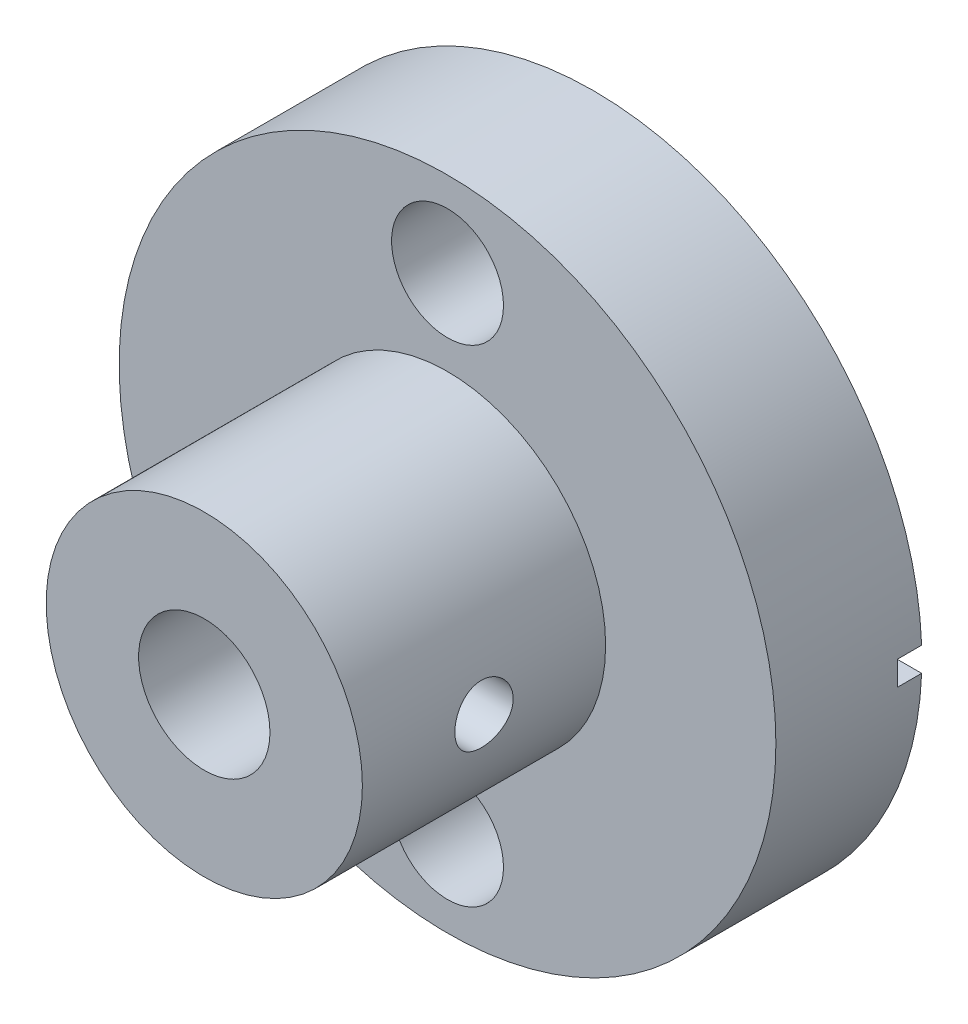
ISO-10303-21;
HEADER;
FILE_DESCRIPTION(('STEP AP214'),'2;1');
FILE_NAME('part.step','',(''),(''),'','','');
FILE_SCHEMA(('AUTOMOTIVE_DESIGN { 1 0 10303 214 1 1 1 1 }'));
ENDSEC;
DATA;
#1=APPLICATION_CONTEXT('core data for automotive mechanical design processes');
#2=APPLICATION_PROTOCOL_DEFINITION('international standard','automotive_design',2000,#1);
#3=PRODUCT_CONTEXT('',#1,'mechanical');
#4=PRODUCT('Part','Part','',(#3));
#5=PRODUCT_RELATED_PRODUCT_CATEGORY('part','',(#4));
#6=PRODUCT_DEFINITION_FORMATION('','',#4);
#7=PRODUCT_DEFINITION_CONTEXT('part definition',#1,'design');
#8=PRODUCT_DEFINITION('design','',#6,#7);
#9=PRODUCT_DEFINITION_SHAPE('','',#8);
#10=(LENGTH_UNIT() NAMED_UNIT(*) SI_UNIT(.MILLI.,.METRE.));
#11=(NAMED_UNIT(*) PLANE_ANGLE_UNIT() SI_UNIT($,.RADIAN.));
#12=(NAMED_UNIT(*) SI_UNIT($,.STERADIAN.) SOLID_ANGLE_UNIT());
#13=UNCERTAINTY_MEASURE_WITH_UNIT(LENGTH_MEASURE(1.E-05),#10,'distance_accuracy_value','');
#14=(GEOMETRIC_REPRESENTATION_CONTEXT(3) GLOBAL_UNCERTAINTY_ASSIGNED_CONTEXT((#13)) GLOBAL_UNIT_ASSIGNED_CONTEXT((#10,
#11,#12)) REPRESENTATION_CONTEXT('',''));
#15=CARTESIAN_POINT('',(0.,0.,0.));
#16=DIRECTION('',(0.,0.,1.));
#17=DIRECTION('',(1.,0.,0.));
#18=AXIS2_PLACEMENT_3D('',#15,#16,#17);
#19=CARTESIAN_POINT('',(0.,0.,6.));
#20=DIRECTION('',(0.,0.,-1.));
#21=DIRECTION('',(-1.,0.,0.));
#22=AXIS2_PLACEMENT_3D('',#19,#20,#21);
#23=CYLINDRICAL_SURFACE('',#22,13.5);
#24=CARTESIAN_POINT('',(0.,0.,6.));
#25=DIRECTION('',(0.,0.,1.));
#26=DIRECTION('',(1.,0.,0.));
#27=AXIS2_PLACEMENT_3D('',#24,#25,#26);
#28=CIRCLE('',#27,13.5);
#29=CARTESIAN_POINT('',(13.5,0.,6.));
#30=VERTEX_POINT('',#29);
#31=EDGE_CURVE('E196',#30,#30,#28,.T.);
#32=ORIENTED_EDGE('',*,*,#31,.F.);
#33=EDGE_LOOP('',(#32));
#34=FACE_BOUND('',#33,.T.);
#35=DIRECTION('',(0.,0.,-1.));
#36=VECTOR('',#35,1.);
#37=CARTESIAN_POINT('',(-13.490737563232,0.5,6.));
#38=LINE('',#37,#36);
#39=CARTESIAN_POINT('',(-13.490737563232,0.5,1.));
#40=VERTEX_POINT('',#39);
#41=CARTESIAN_POINT('',(-13.490737563232,0.5,0.));
#42=VERTEX_POINT('',#41);
#43=EDGE_CURVE('E127',#40,#42,#38,.T.);
#44=ORIENTED_EDGE('',*,*,#43,.F.);
#45=CARTESIAN_POINT('',(0.,0.,1.));
#46=DIRECTION('',(0.,0.,-1.));
#47=DIRECTION('',(-1.,0.,0.));
#48=AXIS2_PLACEMENT_3D('',#45,#46,#47);
#49=CIRCLE('',#48,13.5);
#50=CARTESIAN_POINT('',(-13.490737563232,-0.5,1.));
#51=VERTEX_POINT('',#50);
#52=EDGE_CURVE('E11',#51,#40,#49,.T.);
#53=ORIENTED_EDGE('',*,*,#52,.F.);
#54=DIRECTION('',(0.,0.,-1.));
#55=VECTOR('',#54,1.);
#56=CARTESIAN_POINT('',(-13.490737563232,-0.5,6.));
#57=LINE('',#56,#55);
#58=CARTESIAN_POINT('',(-13.490737563232,-0.5,0.));
#59=VERTEX_POINT('',#58);
#60=EDGE_CURVE('E104',#59,#51,#57,.F.);
#61=ORIENTED_EDGE('',*,*,#60,.F.);
#62=CARTESIAN_POINT('',(0.,0.,0.));
#63=DIRECTION('',(0.,0.,1.));
#64=DIRECTION('',(1.,0.,0.));
#65=AXIS2_PLACEMENT_3D('',#62,#63,#64);
#66=CIRCLE('',#65,13.5);
#67=CARTESIAN_POINT('',(13.490737563232,-0.5,0.));
#68=VERTEX_POINT('',#67);
#69=EDGE_CURVE('E201',#59,#68,#66,.T.);
#70=ORIENTED_EDGE('',*,*,#69,.T.);
#71=DIRECTION('',(0.,0.,-1.));
#72=VECTOR('',#71,1.);
#73=CARTESIAN_POINT('',(13.490737563232,-0.5,6.));
#74=LINE('',#73,#72);
#75=CARTESIAN_POINT('',(13.490737563232,-0.5,1.));
#76=VERTEX_POINT('',#75);
#77=EDGE_CURVE('E147',#68,#76,#74,.F.);
#78=ORIENTED_EDGE('',*,*,#77,.T.);
#79=CARTESIAN_POINT('',(0.,0.,1.));
#80=DIRECTION('',(0.,0.,-1.));
#81=DIRECTION('',(-1.,0.,0.));
#82=AXIS2_PLACEMENT_3D('',#79,#80,#81);
#83=CIRCLE('',#82,13.5);
#84=CARTESIAN_POINT('',(13.490737563232,0.5,1.));
#85=VERTEX_POINT('',#84);
#86=EDGE_CURVE('E195',#85,#76,#83,.T.);
#87=ORIENTED_EDGE('',*,*,#86,.F.);
#88=DIRECTION('',(0.,0.,-1.));
#89=VECTOR('',#88,1.);
#90=CARTESIAN_POINT('',(13.490737563232,0.5,6.));
#91=LINE('',#90,#89);
#92=CARTESIAN_POINT('',(13.490737563232,0.5,0.));
#93=VERTEX_POINT('',#92);
#94=EDGE_CURVE('E143',#85,#93,#91,.T.);
#95=ORIENTED_EDGE('',*,*,#94,.T.);
#96=EDGE_CURVE('E186',#93,#42,#66,.T.);
#97=ORIENTED_EDGE('',*,*,#96,.T.);
#98=EDGE_LOOP('',(#44,#53,#61,#70,#78,#87,#95,#97));
#99=FACE_BOUND('',#98,.T.);
#100=ADVANCED_FACE('F34',(#34,#99),#23,.T.);
#101=CARTESIAN_POINT('',(0.,0.,0.));
#102=DIRECTION('',(0.,0.,1.));
#103=DIRECTION('',(1.,0.,0.));
#104=AXIS2_PLACEMENT_3D('',#101,#102,#103);
#105=PLANE('',#104);
#106=CARTESIAN_POINT('',(0.,0.,0.));
#107=DIRECTION('',(0.,0.,1.));
#108=DIRECTION('',(1.,0.,0.));
#109=AXIS2_PLACEMENT_3D('',#106,#107,#108);
#110=CIRCLE('',#109,2.7);
#111=CARTESIAN_POINT('',(2.7,0.,0.));
#112=VERTEX_POINT('',#111);
#113=EDGE_CURVE('E250',#112,#112,#110,.F.);
#114=ORIENTED_EDGE('',*,*,#113,.F.);
#115=EDGE_LOOP('',(#114));
#116=FACE_BOUND('',#115,.T.);
#117=CARTESIAN_POINT('',(0.,10.,0.));
#118=DIRECTION('',(0.,0.,1.));
#119=DIRECTION('',(1.,0.,0.));
#120=AXIS2_PLACEMENT_3D('',#117,#118,#119);
#121=CIRCLE('',#120,2.3);
#122=CARTESIAN_POINT('',(2.3,10.,0.));
#123=VERTEX_POINT('',#122);
#124=EDGE_CURVE('E157',#123,#123,#121,.T.);
#125=ORIENTED_EDGE('',*,*,#124,.T.);
#126=EDGE_LOOP('',(#125));
#127=FACE_BOUND('',#126,.T.);
#128=CARTESIAN_POINT('',(0.,-10.,0.));
#129=DIRECTION('',(0.,0.,1.));
#130=DIRECTION('',(1.,0.,0.));
#131=AXIS2_PLACEMENT_3D('',#128,#129,#130);
#132=CIRCLE('',#131,2.3);
#133=CARTESIAN_POINT('',(2.3,-10.,0.));
#134=VERTEX_POINT('',#133);
#135=EDGE_CURVE('E153',#134,#134,#132,.F.);
#136=ORIENTED_EDGE('',*,*,#135,.F.);
#137=EDGE_LOOP('',(#136));
#138=FACE_BOUND('',#137,.T.);
#139=DIRECTION('',(-1.,0.,0.));
#140=VECTOR('',#139,1.);
#141=CARTESIAN_POINT('',(-18.5,0.5,0.));
#142=LINE('',#141,#140);
#143=CARTESIAN_POINT('',(-8.5,0.5,0.));
#144=VERTEX_POINT('',#143);
#145=EDGE_CURVE('E118',#144,#42,#142,.T.);
#146=ORIENTED_EDGE('',*,*,#145,.T.);
#147=ORIENTED_EDGE('',*,*,#96,.F.);
#148=DIRECTION('',(1.,0.,0.));
#149=VECTOR('',#148,1.);
#150=CARTESIAN_POINT('',(18.5,0.5,0.));
#151=LINE('',#150,#149);
#152=CARTESIAN_POINT('',(8.5,0.5,0.));
#153=VERTEX_POINT('',#152);
#154=EDGE_CURVE('E133',#153,#93,#151,.T.);
#155=ORIENTED_EDGE('',*,*,#154,.F.);
#156=DIRECTION('',(0.,1.,0.));
#157=VECTOR('',#156,1.);
#158=CARTESIAN_POINT('',(8.5,0.5,0.));
#159=LINE('',#158,#157);
#160=CARTESIAN_POINT('',(8.5,-0.5,0.));
#161=VERTEX_POINT('',#160);
#162=EDGE_CURVE('E56',#161,#153,#159,.T.);
#163=ORIENTED_EDGE('',*,*,#162,.F.);
#164=DIRECTION('',(1.,0.,0.));
#165=VECTOR('',#164,1.);
#166=CARTESIAN_POINT('',(0.,-0.5,0.));
#167=LINE('',#166,#165);
#168=EDGE_CURVE('E192',#161,#68,#167,.T.);
#169=ORIENTED_EDGE('',*,*,#168,.T.);
#170=ORIENTED_EDGE('',*,*,#69,.F.);
#171=DIRECTION('',(-1.,0.,0.));
#172=VECTOR('',#171,1.);
#173=CARTESIAN_POINT('',(0.,-0.5,0.));
#174=LINE('',#173,#172);
#175=CARTESIAN_POINT('',(-8.5,-0.5,0.));
#176=VERTEX_POINT('',#175);
#177=EDGE_CURVE('E41',#176,#59,#174,.T.);
#178=ORIENTED_EDGE('',*,*,#177,.F.);
#179=DIRECTION('',(0.,1.,0.));
#180=VECTOR('',#179,1.);
#181=CARTESIAN_POINT('',(-8.5,0.5,0.));
#182=LINE('',#181,#180);
#183=EDGE_CURVE('E48',#176,#144,#182,.T.);
#184=ORIENTED_EDGE('',*,*,#183,.T.);
#185=EDGE_LOOP('',(#146,#147,#155,#163,#169,#170,#178,#184));
#186=FACE_BOUND('',#185,.T.);
#187=ADVANCED_FACE('F203',(#116,#127,#138,#186),#105,.F.);
#188=CARTESIAN_POINT('',(25.,0.,11.));
#189=DIRECTION('',(-1.,0.,0.));
#190=DIRECTION('',(0.,0.,1.));
#191=AXIS2_PLACEMENT_3D('',#188,#189,#190);
#192=CYLINDRICAL_SURFACE('',#191,1.2);
#193=CARTESIAN_POINT('',(6.5,0.,12.2));
#194=CARTESIAN_POINT('',(6.49999879727572,-0.0667962993626081,12.1999974278829));
#195=CARTESIAN_POINT('',(6.49895972178335,-0.133626281673587,12.1944039721681));
#196=CARTESIAN_POINT('',(6.49491478174011,-0.265404300030401,12.172191600608));
#197=CARTESIAN_POINT('',(6.49190723570874,-0.330350677512255,12.1555632585209));
#198=CARTESIAN_POINT('',(6.48426191804226,-0.456436519782737,12.1118065638594));
#199=CARTESIAN_POINT('',(6.47962559903149,-0.517579319792999,12.0846875652248));
#200=CARTESIAN_POINT('',(6.46922952137734,-0.63444110969497,12.0207456276995));
#201=CARTESIAN_POINT('',(6.46346985907829,-0.690160564109868,11.9839235209079));
#202=CARTESIAN_POINT('',(6.45138834939994,-0.795247744205699,11.9011660344249));
#203=CARTESIAN_POINT('',(6.44506127279023,-0.844543292388614,11.8551397561373));
#204=CARTESIAN_POINT('',(6.43259702053078,-0.934759066401608,11.7554760006652));
#205=CARTESIAN_POINT('',(6.42645985829691,-0.975678701684754,11.7018379872634));
#206=CARTESIAN_POINT('',(6.41501951319584,-1.04827972317034,11.5879653111489));
#207=CARTESIAN_POINT('',(6.40972307507926,-1.07988798202191,11.5276832879546));
#208=CARTESIAN_POINT('',(6.40063738902812,-1.13250094978906,11.4025506689439));
#209=CARTESIAN_POINT('',(6.39684801526784,-1.15350654396689,11.3377004550609));
#210=CARTESIAN_POINT('',(6.39125806003697,-1.18408687284635,11.2060436035491));
#211=CARTESIAN_POINT('',(6.38943562620813,-1.19378730462821,11.1392671080334));
#212=CARTESIAN_POINT('',(6.38791998048299,-1.20187204389847,11.0050113933146));
#213=CARTESIAN_POINT('',(6.38822658354097,-1.20025733484479,10.9375322356926));
#214=CARTESIAN_POINT('',(6.39091446543458,-1.18585961873334,10.8046953870345));
#215=CARTESIAN_POINT('',(6.39326923845306,-1.17321929073711,10.7393216161376));
#216=CARTESIAN_POINT('',(6.39974652439446,-1.13735373323502,10.6116388619997));
#217=CARTESIAN_POINT('',(6.40386911035101,-1.11412806641468,10.5493300054981));
#218=CARTESIAN_POINT('',(6.41344535336497,-1.05761084900825,10.4291269281805));
#219=CARTESIAN_POINT('',(6.41890662438299,-1.0242614500129,10.3712605382117));
#220=CARTESIAN_POINT('',(6.43053982016241,-0.948484370023446,10.2618912881752));
#221=CARTESIAN_POINT('',(6.43671181488758,-0.906055794920213,10.2103890556326));
#222=CARTESIAN_POINT('',(6.44918666593044,-0.812554310960555,10.1143854911831));
#223=CARTESIAN_POINT('',(6.45549008145401,-0.761359307961523,10.0700030583735));
#224=CARTESIAN_POINT('',(6.46743086297198,-0.652187389345437,9.9904388129452));
#225=CARTESIAN_POINT('',(6.47306822266922,-0.594210409619175,9.95525708730987));
#226=CARTESIAN_POINT('',(6.48305257458405,-0.472998043002824,9.89507639819467));
#227=CARTESIAN_POINT('',(6.48739803241448,-0.409756516582691,9.87008953010376));
#228=CARTESIAN_POINT('',(6.49429705012122,-0.279875838888337,9.83112661435116));
#229=CARTESIAN_POINT('',(6.49685079444502,-0.213237038103507,9.8171494332818));
#230=CARTESIAN_POINT('',(6.49985338930874,-0.0794766430718829,9.80076752083491));
#231=CARTESIAN_POINT('',(6.50033187707818,-0.0123756497053712,9.79819983464421));
#232=CARTESIAN_POINT('',(6.49921181273706,0.121296981962713,9.8042730761626));
#233=CARTESIAN_POINT('',(6.49761335943468,0.187868645294989,9.8129134706596));
#234=CARTESIAN_POINT('',(6.49253745576473,0.318077984755796,9.84102211191283));
#235=CARTESIAN_POINT('',(6.48907427500552,0.381734009693139,9.86040816155233));
#236=CARTESIAN_POINT('',(6.4806556240529,0.504892375398316,9.9093690573418));
#237=CARTESIAN_POINT('',(6.47570005497306,0.564394440600633,9.93894457867032));
#238=CARTESIAN_POINT('',(6.4647724074758,0.678253095830679,10.0078073610227));
#239=CARTESIAN_POINT('',(6.45879008348503,0.732548265605505,10.0471945163265));
#240=CARTESIAN_POINT('',(6.44649953986676,0.833816870545852,10.1344270136108));
#241=CARTESIAN_POINT('',(6.44019129083715,0.880789643607566,10.1822731196305));
#242=CARTESIAN_POINT('',(6.42786191143313,0.966697085412809,10.2858021083737));
#243=CARTESIAN_POINT('',(6.42184551244879,1.00552070246097,10.3415777973493));
#244=CARTESIAN_POINT('',(6.41087523291019,1.07324774919417,10.4589549357169));
#245=CARTESIAN_POINT('',(6.40592131362856,1.10215154047974,10.5205561726499));
#246=CARTESIAN_POINT('',(6.39767379439307,1.14905975241548,10.6475497087302));
#247=CARTESIAN_POINT('',(6.39437235713613,1.16711570494917,10.7129224406376));
#248=CARTESIAN_POINT('',(6.38978543443045,1.19197513111159,10.8458401771607));
#249=CARTESIAN_POINT('',(6.38849972926177,1.19877983115992,10.9133849441999));
#250=CARTESIAN_POINT('',(6.3881007482456,1.20090353537778,11.0476175572827));
#251=CARTESIAN_POINT('',(6.38895435075601,1.19639765292492,11.1143025975303));
#252=CARTESIAN_POINT('',(6.39266448585662,1.17641079397786,11.2459474188607));
#253=CARTESIAN_POINT('',(6.39552100733921,1.16092987834811,11.310907209509));
#254=CARTESIAN_POINT('',(6.40290136886896,1.11950532017773,11.4371671962626));
#255=CARTESIAN_POINT('',(6.40742227523992,1.09358007946632,11.4984736122883));
#256=CARTESIAN_POINT('',(6.41762418955728,1.032021760182,11.6158947376739));
#257=CARTESIAN_POINT('',(6.42330527598439,0.996388024820644,11.6720090954421));
#258=CARTESIAN_POINT('',(6.43529057182139,0.915813071798076,11.7783315161889));
#259=CARTESIAN_POINT('',(6.44160263227606,0.870744203302652,11.8284419719686));
#260=CARTESIAN_POINT('',(6.45407937835197,0.772845002820405,11.9204475390134));
#261=CARTESIAN_POINT('',(6.46024402977463,0.720012889705214,11.9623407598269));
#262=CARTESIAN_POINT('',(6.47179409996219,0.607537484977904,12.0370617405115));
#263=CARTESIAN_POINT('',(6.47717228318667,0.547839004017674,12.0698075747291));
#264=CARTESIAN_POINT('',(6.48647285935735,0.42370854944922,12.124752828699));
#265=CARTESIAN_POINT('',(6.49039663100581,0.3592811283988,12.1469622420194));
#266=CARTESIAN_POINT('',(6.49553807584249,0.245545866371185,12.1756491928211));
#267=CARTESIAN_POINT('',(6.49720192234607,0.196906528350574,12.1847652844566));
#268=CARTESIAN_POINT('',(6.49943331626516,0.0988509306569767,12.1969415668264));
#269=CARTESIAN_POINT('',(6.50000089011371,0.0494346897454305,12.2000019035757));
#270=CARTESIAN_POINT('',(6.5,0.,12.2));
#271=B_SPLINE_CURVE_WITH_KNOTS('',3,(#193,#194,#195,#196,#197,#198,#199,#200,#201,#202,#203,
#204,#205,#206,#207,#208,#209,#210,#211,#212,#213,#214,#215,#216,#217,#218,#219,#220,#221,#222,
#223,#224,#225,#226,#227,#228,#229,#230,#231,#232,#233,#234,#235,#236,#237,#238,#239,#240,#241,
#242,#243,#244,#245,#246,#247,#248,#249,#250,#251,#252,#253,#254,#255,#256,#257,#258,#259,#260,
#261,#262,#263,#264,#265,#266,#267,#268,#269,#270),.UNSPECIFIED.,.T.,.F.,(4,2,2,2,2,2,2,2,2,2,2,
2,2,2,2,2,2,2,2,2,2,2,2,2,2,2,2,2,2,2,2,2,2,2,2,2,2,2,4),(0.,0.200208125257265,
0.400587493204053,0.600788604213543,0.800972552376601,1.00324088953467,1.20552348279051,
1.40935476877731,1.61316903319364,1.81469487992138,2.01620321120369,2.21514193787252,
2.41408888408644,2.61419475105378,2.81432033334393,3.01750151628566,3.2206846200298,
3.42410808829514,3.6275106121083,3.8279985269071,4.02847690406412,4.22744250539259,
4.42642129319003,4.62751523490318,4.8286273493452,5.03232388047527,5.23601298560803,
5.43872666786995,5.64141825228765,5.84099112816951,6.04056289728494,6.23978456857919,
6.43901972074741,6.64114822168659,6.84332316977221,7.04725467103852,7.25099235904022,
7.39916621446434,7.54733649711547),.UNSPECIFIED.);
#272=CARTESIAN_POINT('',(6.5,0.,12.2));
#273=VERTEX_POINT('',#272);
#274=EDGE_CURVE('E246',#273,#273,#271,.T.);
#275=ORIENTED_EDGE('',*,*,#274,.T.);
#276=EDGE_LOOP('',(#275));
#277=FACE_BOUND('',#276,.T.);
#278=CARTESIAN_POINT('',(2.7,0.,12.2));
#279=CARTESIAN_POINT('',(2.69999413362057,0.0639065591023064,12.1999923831793));
#280=CARTESIAN_POINT('',(2.69770564197874,0.127893036523807,12.1948654918272));
#281=CARTESIAN_POINT('',(2.68877100210596,0.25403557600969,12.1745501771965));
#282=CARTESIAN_POINT('',(2.68211438349655,0.316186864128076,12.1593375776189));
#283=CARTESIAN_POINT('',(2.66515409854901,0.436621100359764,12.1195393890298));
#284=CARTESIAN_POINT('',(2.65486345340692,0.494916988807218,12.0949872409192));
#285=CARTESIAN_POINT('',(2.63161770990452,0.606498876298807,12.0373549198206));
#286=CARTESIAN_POINT('',(2.61866321902908,0.659786013548984,12.0042766907538));
#287=CARTESIAN_POINT('',(2.59055992340384,0.762887990999931,11.9285990703182));
#288=CARTESIAN_POINT('',(2.57533308413914,0.81238898179779,11.8856014072593));
#289=CARTESIAN_POINT('',(2.54471118380751,0.903753990005821,11.7921510489153));
#290=CARTESIAN_POINT('',(2.52931602821855,0.945613455081426,11.7416939419488));
#291=CARTESIAN_POINT('',(2.49909628261832,1.02290764342971,11.6312367647985));
#292=CARTESIAN_POINT('',(2.48435595827186,1.05783186961991,11.5708539108751));
#293=CARTESIAN_POINT('',(2.45837526696494,1.11688834822608,11.4443268523912));
#294=CARTESIAN_POINT('',(2.44713285796118,1.14102690079927,11.3781860382369));
#295=CARTESIAN_POINT('',(2.43027734905002,1.17648691470213,11.2456277716151));
#296=CARTESIAN_POINT('',(2.42439919523154,1.18841590189109,11.1794079593235));
#297=CARTESIAN_POINT('',(2.41818878362474,1.20100696979013,11.0456661379365));
#298=CARTESIAN_POINT('',(2.4178528219447,1.20167657524167,10.9781450287237));
#299=CARTESIAN_POINT('',(2.42254366026567,1.19218298581507,10.8501827308142));
#300=CARTESIAN_POINT('',(2.4270931542614,1.18298402341183,10.7896487784958));
#301=CARTESIAN_POINT('',(2.44022617227002,1.15564860756994,10.6710948650284));
#302=CARTESIAN_POINT('',(2.44881060282323,1.13751014562483,10.6130754720334));
#303=CARTESIAN_POINT('',(2.46924514284841,1.09245124275327,10.4996398233602));
#304=CARTESIAN_POINT('',(2.48116423077023,1.06534281441842,10.4443112329153));
#305=CARTESIAN_POINT('',(2.50691446994658,1.00324870493604,10.3387544513155));
#306=CARTESIAN_POINT('',(2.52074642529426,0.968259707202767,10.2885284205557));
#307=CARTESIAN_POINT('',(2.55039983349783,0.887404851023686,10.1894518391137));
#308=CARTESIAN_POINT('',(2.56628383219961,0.840811456550148,10.1412119129495));
#309=CARTESIAN_POINT('',(2.59712939767392,0.740062927274395,10.0530095338656));
#310=CARTESIAN_POINT('',(2.61209068461612,0.68590551463452,10.0130495834241));
#311=CARTESIAN_POINT('',(2.63995469383987,0.569491655107122,9.94147206336678));
#312=CARTESIAN_POINT('',(2.6527835515846,0.507043222559378,9.91013579408398));
#313=CARTESIAN_POINT('',(2.67435348404006,0.377044453719878,9.85863383005269));
#314=CARTESIAN_POINT('',(2.68309713525878,0.309497364424834,9.83846109306621));
#315=CARTESIAN_POINT('',(2.69500955063424,0.176292321296718,9.81121287038837));
#316=CARTESIAN_POINT('',(2.69852547661778,0.110832697825019,9.80331998164941));
#317=CARTESIAN_POINT('',(2.70072002319156,-0.020566223274589,9.7983781261587));
#318=CARTESIAN_POINT('',(2.69940028683998,-0.0865053503783305,9.80132547611901));
#319=CARTESIAN_POINT('',(2.69229177327389,-0.212944450043092,9.8174261436085));
#320=CARTESIAN_POINT('',(2.6867671065459,-0.273537850639587,9.8299765355117));
#321=CARTESIAN_POINT('',(2.67210325388452,-0.391675243775097,9.86405478746183));
#322=CARTESIAN_POINT('',(2.66296362867872,-0.449218864755503,9.88558373855752));
#323=CARTESIAN_POINT('',(2.64157426404399,-0.561662431159979,9.93769332944624));
#324=CARTESIAN_POINT('',(2.62923639136989,-0.616423892001831,9.96853540826862));
#325=CARTESIAN_POINT('',(2.60272873830794,-0.720191567250078,10.0381108556107));
#326=CARTESIAN_POINT('',(2.58855816108654,-0.769195260470478,10.0768476608872));
#327=CARTESIAN_POINT('',(2.5584767589195,-0.864220327521456,10.1647500678792));
#328=CARTESIAN_POINT('',(2.54251772459568,-0.909683032438224,10.2145045624883));
#329=CARTESIAN_POINT('',(2.51162480970985,-0.991801453598339,10.3211332041893));
#330=CARTESIAN_POINT('',(2.49669129392246,-1.02845404757698,10.3780098645164));
#331=CARTESIAN_POINT('',(2.46928674093927,-1.09264543882237,10.4990745846855));
#332=CARTESIAN_POINT('',(2.45688177642213,-1.11994996636762,10.5634029898212));
#333=CARTESIAN_POINT('',(2.4367650168031,-1.16307895210515,10.6964760891825));
#334=CARTESIAN_POINT('',(2.42904862954254,-1.1789146462074,10.7652163890263));
#335=CARTESIAN_POINT('',(2.41995032134622,-1.19747128693734,10.8988889457178));
#336=CARTESIAN_POINT('',(2.41808692940897,-1.20119006801553,10.9636501271561));
#337=CARTESIAN_POINT('',(2.41959773517966,-1.19814464927904,11.0928557618811));
#338=CARTESIAN_POINT('',(2.42297081605554,-1.19138268479251,11.157300279765));
#339=CARTESIAN_POINT('',(2.43410978875393,-1.16844135931616,11.2800151564985));
#340=CARTESIAN_POINT('',(2.44159919634577,-1.15285303217351,11.3384237119317));
#341=CARTESIAN_POINT('',(2.45987368091073,-1.11332516751525,11.4517891509191));
#342=CARTESIAN_POINT('',(2.4706597105559,-1.08938321564955,11.5067450311624));
#343=CARTESIAN_POINT('',(2.49516633461298,-1.03207265496533,11.6155025669727));
#344=CARTESIAN_POINT('',(2.50903068581858,-0.998198297609607,11.6690045975486));
#345=CARTESIAN_POINT('',(2.53778753442993,-0.922641583993335,11.7698748803223));
#346=CARTESIAN_POINT('',(2.55268045962436,-0.880955966494673,11.8172405565419));
#347=CARTESIAN_POINT('',(2.58337941872399,-0.78664877081698,11.9087734791821));
#348=CARTESIAN_POINT('',(2.59915136690634,-0.733389540278599,11.9522984992548));
#349=CARTESIAN_POINT('',(2.62855906078181,-0.619771086799431,12.0298610087285));
#350=CARTESIAN_POINT('',(2.64219382936338,-0.559408638242745,12.0638941639895));
#351=CARTESIAN_POINT('',(2.66567555365819,-0.433830067434941,12.1209347672237));
#352=CARTESIAN_POINT('',(2.67556359629795,-0.368676545242857,12.1440625356446));
#353=CARTESIAN_POINT('',(2.69059030099947,-0.234972811511182,12.178782185816));
#354=CARTESIAN_POINT('',(2.69574344748542,-0.166433639459938,12.1904092575191));
#355=CARTESIAN_POINT('',(2.69941490841779,-0.0650184194495728,12.1986821692355));
#356=CARTESIAN_POINT('',(2.70000298517181,-0.032519556731023,12.2000038759031));
#357=CARTESIAN_POINT('',(2.7,0.,12.2));
#358=B_SPLINE_CURVE_WITH_KNOTS('',3,(#278,#279,#280,#281,#282,#283,#284,#285,#286,#287,#288,
#289,#290,#291,#292,#293,#294,#295,#296,#297,#298,#299,#300,#301,#302,#303,#304,#305,#306,#307,
#308,#309,#310,#311,#312,#313,#314,#315,#316,#317,#318,#319,#320,#321,#322,#323,#324,#325,#326,
#327,#328,#329,#330,#331,#332,#333,#334,#335,#336,#337,#338,#339,#340,#341,#342,#343,#344,#345,
#346,#347,#348,#349,#350,#351,#352,#353,#354,#355,#356,#357),.UNSPECIFIED.,.T.,.F.,(4,2,2,2,2,2,
2,2,2,2,2,2,2,2,2,2,2,2,2,2,2,2,2,2,2,2,2,2,2,2,2,2,2,2,2,2,2,2,2,4),(0.,0.191618254692132,
0.383697503423909,0.57509537585916,0.766449648689667,0.96752346516017,1.16871668045946,
1.38152637924487,1.59421160802032,1.7957068529561,1.99706743153409,2.18040510018399,
2.36378397951647,2.55127911192394,2.73885330073873,2.94470008049905,3.15060898340504,
3.3626003754159,3.57445788501979,3.77149687786056,3.96846892713029,4.15399671722493,
4.33954705869644,4.53088617326196,4.72230876076459,4.92915910001196,5.13608263838593,
5.34786609388025,5.55944178537991,5.753084399156,5.94668571861527,6.12863978970841,
6.31064649247104,6.50431618226569,6.69806691096097,6.9087661101249,7.11956136104833,
7.32797307084532,7.53574508917101,7.63325214934906),.UNSPECIFIED.);
#359=CARTESIAN_POINT('',(2.7,0.,12.2));
#360=VERTEX_POINT('',#359);
#361=EDGE_CURVE('E158',#360,#360,#358,.T.);
#362=ORIENTED_EDGE('',*,*,#361,.T.);
#363=EDGE_LOOP('',(#362));
#364=FACE_BOUND('',#363,.T.);
#365=ADVANCED_FACE('F168',(#277,#364),#192,.F.);
#366=CARTESIAN_POINT('',(-6.5,0.,12.2));
#367=CARTESIAN_POINT('',(-6.49999879727572,0.0667962993626081,12.1999974278829));
#368=CARTESIAN_POINT('',(-6.49895972178335,0.133626281673587,12.1944039721681));
#369=CARTESIAN_POINT('',(-6.49491478174011,0.265404300030401,12.172191600608));
#370=CARTESIAN_POINT('',(-6.49190723570874,0.330350677512255,12.1555632585209));
#371=CARTESIAN_POINT('',(-6.48426191804226,0.456436519782737,12.1118065638594));
#372=CARTESIAN_POINT('',(-6.47962559903149,0.517579319792999,12.0846875652248));
#373=CARTESIAN_POINT('',(-6.46922952137734,0.63444110969497,12.0207456276995));
#374=CARTESIAN_POINT('',(-6.46346985907829,0.690160564109868,11.9839235209079));
#375=CARTESIAN_POINT('',(-6.45138834939994,0.795247744205699,11.9011660344249));
#376=CARTESIAN_POINT('',(-6.44506127279023,0.844543292388614,11.8551397561373));
#377=CARTESIAN_POINT('',(-6.43259702053078,0.934759066401608,11.7554760006652));
#378=CARTESIAN_POINT('',(-6.42645985829691,0.975678701684754,11.7018379872634));
#379=CARTESIAN_POINT('',(-6.41501951319584,1.04827972317034,11.5879653111489));
#380=CARTESIAN_POINT('',(-6.40972307507926,1.07988798202191,11.5276832879546));
#381=CARTESIAN_POINT('',(-6.40063738902812,1.13250094978906,11.4025506689439));
#382=CARTESIAN_POINT('',(-6.39684801526784,1.15350654396689,11.3377004550609));
#383=CARTESIAN_POINT('',(-6.39125806003697,1.18408687284635,11.2060436035491));
#384=CARTESIAN_POINT('',(-6.38943562620813,1.19378730462821,11.1392671080334));
#385=CARTESIAN_POINT('',(-6.38791998048299,1.20187204389847,11.0050113933146));
#386=CARTESIAN_POINT('',(-6.38822658354097,1.20025733484479,10.9375322356926));
#387=CARTESIAN_POINT('',(-6.39091446543458,1.18585961873334,10.8046953870345));
#388=CARTESIAN_POINT('',(-6.39326923845306,1.17321929073711,10.7393216161376));
#389=CARTESIAN_POINT('',(-6.39974652439446,1.13735373323502,10.6116388619997));
#390=CARTESIAN_POINT('',(-6.40386911035101,1.11412806641468,10.5493300054981));
#391=CARTESIAN_POINT('',(-6.41344535336497,1.05761084900825,10.4291269281805));
#392=CARTESIAN_POINT('',(-6.41890662438299,1.0242614500129,10.3712605382117));
#393=CARTESIAN_POINT('',(-6.43053982016241,0.948484370023446,10.2618912881752));
#394=CARTESIAN_POINT('',(-6.43671181488758,0.906055794920213,10.2103890556326));
#395=CARTESIAN_POINT('',(-6.44918666593044,0.812554310960555,10.1143854911831));
#396=CARTESIAN_POINT('',(-6.45549008145401,0.761359307961523,10.0700030583735));
#397=CARTESIAN_POINT('',(-6.46743086297198,0.652187389345437,9.9904388129452));
#398=CARTESIAN_POINT('',(-6.47306822266922,0.594210409619175,9.95525708730987));
#399=CARTESIAN_POINT('',(-6.48305257458405,0.472998043002824,9.89507639819467));
#400=CARTESIAN_POINT('',(-6.48739803241448,0.409756516582691,9.87008953010376));
#401=CARTESIAN_POINT('',(-6.49429705012122,0.279875838888337,9.83112661435116));
#402=CARTESIAN_POINT('',(-6.49685079444502,0.213237038103507,9.8171494332818));
#403=CARTESIAN_POINT('',(-6.49985338930874,0.0794766430718829,9.80076752083491));
#404=CARTESIAN_POINT('',(-6.50033187707818,0.0123756497053712,9.79819983464421));
#405=CARTESIAN_POINT('',(-6.49921181273706,-0.121296981962713,9.8042730761626));
#406=CARTESIAN_POINT('',(-6.49761335943468,-0.187868645294989,9.8129134706596));
#407=CARTESIAN_POINT('',(-6.49253745576473,-0.318077984755796,9.84102211191283));
#408=CARTESIAN_POINT('',(-6.48907427500552,-0.381734009693139,9.86040816155233));
#409=CARTESIAN_POINT('',(-6.4806556240529,-0.504892375398316,9.9093690573418));
#410=CARTESIAN_POINT('',(-6.47570005497306,-0.564394440600633,9.93894457867032));
#411=CARTESIAN_POINT('',(-6.4647724074758,-0.678253095830679,10.0078073610227));
#412=CARTESIAN_POINT('',(-6.45879008348503,-0.732548265605505,10.0471945163265));
#413=CARTESIAN_POINT('',(-6.44649953986676,-0.833816870545852,10.1344270136108));
#414=CARTESIAN_POINT('',(-6.44019129083715,-0.880789643607566,10.1822731196305));
#415=CARTESIAN_POINT('',(-6.42786191143313,-0.966697085412809,10.2858021083737));
#416=CARTESIAN_POINT('',(-6.42184551244879,-1.00552070246097,10.3415777973493));
#417=CARTESIAN_POINT('',(-6.41087523291019,-1.07324774919417,10.4589549357169));
#418=CARTESIAN_POINT('',(-6.40592131362856,-1.10215154047974,10.5205561726499));
#419=CARTESIAN_POINT('',(-6.39767379439307,-1.14905975241548,10.6475497087302));
#420=CARTESIAN_POINT('',(-6.39437235713613,-1.16711570494917,10.7129224406376));
#421=CARTESIAN_POINT('',(-6.38978543443045,-1.19197513111159,10.8458401771607));
#422=CARTESIAN_POINT('',(-6.38849972926177,-1.19877983115992,10.9133849441999));
#423=CARTESIAN_POINT('',(-6.3881007482456,-1.20090353537778,11.0476175572827));
#424=CARTESIAN_POINT('',(-6.38895435075601,-1.19639765292492,11.1143025975303));
#425=CARTESIAN_POINT('',(-6.39266448585662,-1.17641079397786,11.2459474188607));
#426=CARTESIAN_POINT('',(-6.39552100733921,-1.16092987834811,11.310907209509));
#427=CARTESIAN_POINT('',(-6.40290136886896,-1.11950532017773,11.4371671962626));
#428=CARTESIAN_POINT('',(-6.40742227523992,-1.09358007946632,11.4984736122883));
#429=CARTESIAN_POINT('',(-6.41762418955728,-1.032021760182,11.6158947376739));
#430=CARTESIAN_POINT('',(-6.42330527598439,-0.996388024820644,11.6720090954421));
#431=CARTESIAN_POINT('',(-6.43529057182139,-0.915813071798076,11.7783315161889));
#432=CARTESIAN_POINT('',(-6.44160263227606,-0.870744203302652,11.8284419719686));
#433=CARTESIAN_POINT('',(-6.45407937835197,-0.772845002820405,11.9204475390134));
#434=CARTESIAN_POINT('',(-6.46024402977463,-0.720012889705214,11.9623407598269));
#435=CARTESIAN_POINT('',(-6.47179409996219,-0.607537484977904,12.0370617405115));
#436=CARTESIAN_POINT('',(-6.47717228318667,-0.547839004017674,12.0698075747291));
#437=CARTESIAN_POINT('',(-6.48647285935735,-0.42370854944922,12.124752828699));
#438=CARTESIAN_POINT('',(-6.49039663100581,-0.3592811283988,12.1469622420194));
#439=CARTESIAN_POINT('',(-6.49553807584249,-0.245545866371185,12.1756491928211));
#440=CARTESIAN_POINT('',(-6.49720192234607,-0.196906528350574,12.1847652844566));
#441=CARTESIAN_POINT('',(-6.49943331626516,-0.0988509306569767,12.1969415668264));
#442=CARTESIAN_POINT('',(-6.50000089011371,-0.0494346897454305,12.2000019035757));
#443=CARTESIAN_POINT('',(-6.5,0.,12.2));
#444=B_SPLINE_CURVE_WITH_KNOTS('',3,(#366,#367,#368,#369,#370,#371,#372,#373,#374,#375,#376,
#377,#378,#379,#380,#381,#382,#383,#384,#385,#386,#387,#388,#389,#390,#391,#392,#393,#394,#395,
#396,#397,#398,#399,#400,#401,#402,#403,#404,#405,#406,#407,#408,#409,#410,#411,#412,#413,#414,
#415,#416,#417,#418,#419,#420,#421,#422,#423,#424,#425,#426,#427,#428,#429,#430,#431,#432,#433,
#434,#435,#436,#437,#438,#439,#440,#441,#442,#443),.UNSPECIFIED.,.T.,.F.,(4,2,2,2,2,2,2,2,2,2,2,
2,2,2,2,2,2,2,2,2,2,2,2,2,2,2,2,2,2,2,2,2,2,2,2,2,2,2,4),(0.,0.200208125257265,
0.400587493204053,0.600788604213543,0.800972552376601,1.00324088953467,1.20552348279051,
1.40935476877731,1.61316903319364,1.81469487992138,2.01620321120369,2.21514193787252,
2.41408888408644,2.61419475105378,2.81432033334393,3.01750151628566,3.2206846200298,
3.42410808829514,3.6275106121083,3.8279985269071,4.02847690406412,4.22744250539259,
4.42642129319003,4.62751523490318,4.8286273493452,5.03232388047527,5.23601298560803,
5.43872666786995,5.64141825228765,5.84099112816951,6.04056289728494,6.23978456857919,
6.43901972074741,6.64114822168659,6.84332316977221,7.04725467103852,7.25099235904022,
7.39916621446434,7.54733649711547),.UNSPECIFIED.);
#445=CARTESIAN_POINT('',(-6.5,0.,12.2));
#446=VERTEX_POINT('',#445);
#447=EDGE_CURVE('E212',#446,#446,#444,.T.);
#448=ORIENTED_EDGE('',*,*,#447,.T.);
#449=EDGE_LOOP('',(#448));
#450=FACE_BOUND('',#449,.T.);
#451=CARTESIAN_POINT('',(-2.7,0.,12.2));
#452=CARTESIAN_POINT('',(-2.69999413362057,-0.0639065591023064,12.1999923831793));
#453=CARTESIAN_POINT('',(-2.69770564197874,-0.127893036523807,12.1948654918272));
#454=CARTESIAN_POINT('',(-2.68877100210596,-0.25403557600969,12.1745501771965));
#455=CARTESIAN_POINT('',(-2.68211438349655,-0.316186864128076,12.1593375776189));
#456=CARTESIAN_POINT('',(-2.66515409854901,-0.436621100359764,12.1195393890298));
#457=CARTESIAN_POINT('',(-2.65486345340692,-0.494916988807218,12.0949872409192));
#458=CARTESIAN_POINT('',(-2.63161770990452,-0.606498876298807,12.0373549198206));
#459=CARTESIAN_POINT('',(-2.61866321902908,-0.659786013548984,12.0042766907538));
#460=CARTESIAN_POINT('',(-2.59055992340384,-0.762887990999931,11.9285990703182));
#461=CARTESIAN_POINT('',(-2.57533308413914,-0.81238898179779,11.8856014072593));
#462=CARTESIAN_POINT('',(-2.54471118380751,-0.903753990005821,11.7921510489153));
#463=CARTESIAN_POINT('',(-2.52931602821855,-0.945613455081426,11.7416939419488));
#464=CARTESIAN_POINT('',(-2.49909628261832,-1.02290764342971,11.6312367647985));
#465=CARTESIAN_POINT('',(-2.48435595827186,-1.05783186961991,11.5708539108751));
#466=CARTESIAN_POINT('',(-2.45837526696494,-1.11688834822608,11.4443268523912));
#467=CARTESIAN_POINT('',(-2.44713285796118,-1.14102690079927,11.3781860382369));
#468=CARTESIAN_POINT('',(-2.43027734905002,-1.17648691470213,11.2456277716151));
#469=CARTESIAN_POINT('',(-2.42439919523154,-1.18841590189109,11.1794079593235));
#470=CARTESIAN_POINT('',(-2.41818878362474,-1.20100696979013,11.0456661379365));
#471=CARTESIAN_POINT('',(-2.4178528219447,-1.20167657524167,10.9781450287237));
#472=CARTESIAN_POINT('',(-2.42254366026567,-1.19218298581507,10.8501827308142));
#473=CARTESIAN_POINT('',(-2.4270931542614,-1.18298402341183,10.7896487784958));
#474=CARTESIAN_POINT('',(-2.44022617227002,-1.15564860756994,10.6710948650284));
#475=CARTESIAN_POINT('',(-2.44881060282323,-1.13751014562483,10.6130754720334));
#476=CARTESIAN_POINT('',(-2.46924514284841,-1.09245124275327,10.4996398233602));
#477=CARTESIAN_POINT('',(-2.48116423077023,-1.06534281441842,10.4443112329153));
#478=CARTESIAN_POINT('',(-2.50691446994658,-1.00324870493604,10.3387544513155));
#479=CARTESIAN_POINT('',(-2.52074642529426,-0.968259707202767,10.2885284205557));
#480=CARTESIAN_POINT('',(-2.55039983349783,-0.887404851023686,10.1894518391137));
#481=CARTESIAN_POINT('',(-2.56628383219961,-0.840811456550148,10.1412119129495));
#482=CARTESIAN_POINT('',(-2.59712939767392,-0.740062927274395,10.0530095338656));
#483=CARTESIAN_POINT('',(-2.61209068461612,-0.68590551463452,10.0130495834241));
#484=CARTESIAN_POINT('',(-2.63995469383987,-0.569491655107122,9.94147206336678));
#485=CARTESIAN_POINT('',(-2.6527835515846,-0.507043222559378,9.91013579408398));
#486=CARTESIAN_POINT('',(-2.67435348404006,-0.377044453719878,9.85863383005269));
#487=CARTESIAN_POINT('',(-2.68309713525878,-0.309497364424834,9.83846109306621));
#488=CARTESIAN_POINT('',(-2.69500955063424,-0.176292321296718,9.81121287038837));
#489=CARTESIAN_POINT('',(-2.69852547661778,-0.110832697825019,9.80331998164941));
#490=CARTESIAN_POINT('',(-2.70072002319156,0.020566223274589,9.7983781261587));
#491=CARTESIAN_POINT('',(-2.69940028683998,0.0865053503783305,9.80132547611901));
#492=CARTESIAN_POINT('',(-2.69229177327389,0.212944450043092,9.8174261436085));
#493=CARTESIAN_POINT('',(-2.6867671065459,0.273537850639587,9.8299765355117));
#494=CARTESIAN_POINT('',(-2.67210325388452,0.391675243775097,9.86405478746183));
#495=CARTESIAN_POINT('',(-2.66296362867872,0.449218864755503,9.88558373855752));
#496=CARTESIAN_POINT('',(-2.64157426404399,0.561662431159979,9.93769332944624));
#497=CARTESIAN_POINT('',(-2.62923639136989,0.616423892001831,9.96853540826862));
#498=CARTESIAN_POINT('',(-2.60272873830794,0.720191567250078,10.0381108556107));
#499=CARTESIAN_POINT('',(-2.58855816108654,0.769195260470478,10.0768476608872));
#500=CARTESIAN_POINT('',(-2.5584767589195,0.864220327521456,10.1647500678792));
#501=CARTESIAN_POINT('',(-2.54251772459568,0.909683032438224,10.2145045624883));
#502=CARTESIAN_POINT('',(-2.51162480970985,0.991801453598339,10.3211332041893));
#503=CARTESIAN_POINT('',(-2.49669129392246,1.02845404757698,10.3780098645164));
#504=CARTESIAN_POINT('',(-2.46928674093927,1.09264543882237,10.4990745846855));
#505=CARTESIAN_POINT('',(-2.45688177642213,1.11994996636762,10.5634029898212));
#506=CARTESIAN_POINT('',(-2.4367650168031,1.16307895210515,10.6964760891825));
#507=CARTESIAN_POINT('',(-2.42904862954254,1.1789146462074,10.7652163890263));
#508=CARTESIAN_POINT('',(-2.41995032134622,1.19747128693734,10.8988889457178));
#509=CARTESIAN_POINT('',(-2.41808692940897,1.20119006801553,10.9636501271561));
#510=CARTESIAN_POINT('',(-2.41959773517966,1.19814464927904,11.0928557618811));
#511=CARTESIAN_POINT('',(-2.42297081605554,1.19138268479251,11.157300279765));
#512=CARTESIAN_POINT('',(-2.43410978875393,1.16844135931616,11.2800151564985));
#513=CARTESIAN_POINT('',(-2.44159919634577,1.15285303217351,11.3384237119317));
#514=CARTESIAN_POINT('',(-2.45987368091073,1.11332516751525,11.4517891509191));
#515=CARTESIAN_POINT('',(-2.4706597105559,1.08938321564955,11.5067450311624));
#516=CARTESIAN_POINT('',(-2.49516633461298,1.03207265496533,11.6155025669727));
#517=CARTESIAN_POINT('',(-2.50903068581858,0.998198297609607,11.6690045975486));
#518=CARTESIAN_POINT('',(-2.53778753442993,0.922641583993335,11.7698748803223));
#519=CARTESIAN_POINT('',(-2.55268045962436,0.880955966494673,11.8172405565419));
#520=CARTESIAN_POINT('',(-2.58337941872399,0.78664877081698,11.9087734791821));
#521=CARTESIAN_POINT('',(-2.59915136690634,0.733389540278599,11.9522984992548));
#522=CARTESIAN_POINT('',(-2.62855906078181,0.619771086799431,12.0298610087285));
#523=CARTESIAN_POINT('',(-2.64219382936338,0.559408638242745,12.0638941639895));
#524=CARTESIAN_POINT('',(-2.66567555365819,0.433830067434941,12.1209347672237));
#525=CARTESIAN_POINT('',(-2.67556359629795,0.368676545242857,12.1440625356446));
#526=CARTESIAN_POINT('',(-2.69059030099947,0.234972811511182,12.178782185816));
#527=CARTESIAN_POINT('',(-2.69574344748542,0.166433639459938,12.1904092575191));
#528=CARTESIAN_POINT('',(-2.69941490841779,0.0650184194495728,12.1986821692355));
#529=CARTESIAN_POINT('',(-2.70000298517181,0.032519556731023,12.2000038759031));
#530=CARTESIAN_POINT('',(-2.7,0.,12.2));
#531=B_SPLINE_CURVE_WITH_KNOTS('',3,(#451,#452,#453,#454,#455,#456,#457,#458,#459,#460,#461,
#462,#463,#464,#465,#466,#467,#468,#469,#470,#471,#472,#473,#474,#475,#476,#477,#478,#479,#480,
#481,#482,#483,#484,#485,#486,#487,#488,#489,#490,#491,#492,#493,#494,#495,#496,#497,#498,#499,
#500,#501,#502,#503,#504,#505,#506,#507,#508,#509,#510,#511,#512,#513,#514,#515,#516,#517,#518,
#519,#520,#521,#522,#523,#524,#525,#526,#527,#528,#529,#530),.UNSPECIFIED.,.T.,.F.,(4,2,2,2,2,2,
2,2,2,2,2,2,2,2,2,2,2,2,2,2,2,2,2,2,2,2,2,2,2,2,2,2,2,2,2,2,2,2,2,4),(0.,0.191618254692132,
0.383697503423909,0.57509537585916,0.766449648689667,0.96752346516017,1.16871668045946,
1.38152637924487,1.59421160802032,1.7957068529561,1.99706743153409,2.18040510018399,
2.36378397951647,2.55127911192394,2.73885330073873,2.94470008049905,3.15060898340504,
3.3626003754159,3.57445788501979,3.77149687786056,3.96846892713029,4.15399671722493,
4.33954705869644,4.53088617326196,4.72230876076459,4.92915910001196,5.13608263838593,
5.34786609388025,5.55944178537991,5.753084399156,5.94668571861527,6.12863978970841,
6.31064649247104,6.50431618226569,6.69806691096097,6.9087661101249,7.11956136104833,
7.32797307084532,7.53574508917101,7.63325214934906),.UNSPECIFIED.);
#532=CARTESIAN_POINT('',(-2.7,0.,12.2));
#533=VERTEX_POINT('',#532);
#534=EDGE_CURVE('E166',#533,#533,#531,.T.);
#535=ORIENTED_EDGE('',*,*,#534,.T.);
#536=EDGE_LOOP('',(#535));
#537=FACE_BOUND('',#536,.T.);
#538=ADVANCED_FACE('F234',(#450,#537),#192,.F.);
#539=CARTESIAN_POINT('',(0.,0.,16.));
#540=DIRECTION('',(0.,0.,-1.));
#541=DIRECTION('',(-1.,0.,0.));
#542=AXIS2_PLACEMENT_3D('',#539,#540,#541);
#543=CYLINDRICAL_SURFACE('',#542,6.5);
#544=CARTESIAN_POINT('',(0.,0.,16.));
#545=DIRECTION('',(0.,0.,1.));
#546=DIRECTION('',(1.,0.,0.));
#547=AXIS2_PLACEMENT_3D('',#544,#545,#546);
#548=CIRCLE('',#547,6.5);
#549=CARTESIAN_POINT('',(6.5,0.,16.));
#550=VERTEX_POINT('',#549);
#551=EDGE_CURVE('E204',#550,#550,#548,.T.);
#552=ORIENTED_EDGE('',*,*,#551,.F.);
#553=EDGE_LOOP('',(#552));
#554=FACE_BOUND('',#553,.T.);
#555=CARTESIAN_POINT('',(0.,0.,6.));
#556=DIRECTION('',(0.,0.,1.));
#557=DIRECTION('',(1.,0.,0.));
#558=AXIS2_PLACEMENT_3D('',#555,#556,#557);
#559=CIRCLE('',#558,6.5);
#560=CARTESIAN_POINT('',(6.5,0.,6.));
#561=VERTEX_POINT('',#560);
#562=EDGE_CURVE('E207',#561,#561,#559,.T.);
#563=ORIENTED_EDGE('',*,*,#562,.T.);
#564=EDGE_LOOP('',(#563));
#565=FACE_BOUND('',#564,.T.);
#566=ORIENTED_EDGE('',*,*,#274,.F.);
#567=EDGE_LOOP('',(#566));
#568=FACE_BOUND('',#567,.T.);
#569=ORIENTED_EDGE('',*,*,#447,.F.);
#570=EDGE_LOOP('',(#569));
#571=FACE_BOUND('',#570,.T.);
#572=ADVANCED_FACE('F240',(#554,#565,#568,#571),#543,.T.);
#573=CARTESIAN_POINT('',(0.,0.,6.));
#574=DIRECTION('',(0.,0.,1.));
#575=DIRECTION('',(1.,0.,0.));
#576=AXIS2_PLACEMENT_3D('',#573,#574,#575);
#577=PLANE('',#576);
#578=CARTESIAN_POINT('',(0.,-10.,6.));
#579=DIRECTION('',(0.,0.,-1.));
#580=DIRECTION('',(1.,0.,0.));
#581=AXIS2_PLACEMENT_3D('',#578,#579,#580);
#582=CIRCLE('',#581,2.3);
#583=CARTESIAN_POINT('',(2.3,-10.,6.));
#584=VERTEX_POINT('',#583);
#585=EDGE_CURVE('E150',#584,#584,#582,.T.);
#586=ORIENTED_EDGE('',*,*,#585,.T.);
#587=EDGE_LOOP('',(#586));
#588=FACE_BOUND('',#587,.T.);
#589=CARTESIAN_POINT('',(0.,10.,6.));
#590=DIRECTION('',(0.,0.,1.));
#591=DIRECTION('',(1.,0.,0.));
#592=AXIS2_PLACEMENT_3D('',#589,#590,#591);
#593=CIRCLE('',#592,2.3);
#594=CARTESIAN_POINT('',(2.3,10.,6.));
#595=VERTEX_POINT('',#594);
#596=EDGE_CURVE('E154',#595,#595,#593,.T.);
#597=ORIENTED_EDGE('',*,*,#596,.F.);
#598=EDGE_LOOP('',(#597));
#599=FACE_BOUND('',#598,.T.);
#600=ORIENTED_EDGE('',*,*,#562,.F.);
#601=EDGE_LOOP('',(#600));
#602=FACE_BOUND('',#601,.T.);
#603=ORIENTED_EDGE('',*,*,#31,.T.);
#604=EDGE_LOOP('',(#603));
#605=FACE_BOUND('',#604,.T.);
#606=ADVANCED_FACE('F222',(#588,#599,#602,#605),#577,.T.);
#607=CARTESIAN_POINT('',(0.,0.,16.));
#608=DIRECTION('',(0.,0.,1.));
#609=DIRECTION('',(1.,0.,0.));
#610=AXIS2_PLACEMENT_3D('',#607,#608,#609);
#611=PLANE('',#610);
#612=CARTESIAN_POINT('',(0.,0.,16.));
#613=DIRECTION('',(0.,0.,1.));
#614=DIRECTION('',(1.,0.,0.));
#615=AXIS2_PLACEMENT_3D('',#612,#613,#614);
#616=CIRCLE('',#615,2.7);
#617=CARTESIAN_POINT('',(2.7,0.,16.));
#618=VERTEX_POINT('',#617);
#619=EDGE_CURVE('E165',#618,#618,#616,.F.);
#620=ORIENTED_EDGE('',*,*,#619,.T.);
#621=EDGE_LOOP('',(#620));
#622=FACE_BOUND('',#621,.T.);
#623=ORIENTED_EDGE('',*,*,#551,.T.);
#624=EDGE_LOOP('',(#623));
#625=FACE_BOUND('',#624,.T.);
#626=ADVANCED_FACE('F176',(#622,#625),#611,.T.);
#627=CARTESIAN_POINT('',(0.,0.,56.));
#628=DIRECTION('',(0.,0.,-1.));
#629=DIRECTION('',(-1.,0.,0.));
#630=AXIS2_PLACEMENT_3D('',#627,#628,#629);
#631=CYLINDRICAL_SURFACE('',#630,2.7);
#632=ORIENTED_EDGE('',*,*,#534,.F.);
#633=EDGE_LOOP('',(#632));
#634=FACE_BOUND('',#633,.T.);
#635=ORIENTED_EDGE('',*,*,#361,.F.);
#636=EDGE_LOOP('',(#635));
#637=FACE_BOUND('',#636,.T.);
#638=ORIENTED_EDGE('',*,*,#619,.F.);
#639=EDGE_LOOP('',(#638));
#640=FACE_BOUND('',#639,.T.);
#641=ORIENTED_EDGE('',*,*,#113,.T.);
#642=EDGE_LOOP('',(#641));
#643=FACE_BOUND('',#642,.T.);
#644=ADVANCED_FACE('F171',(#634,#637,#640,#643),#631,.F.);
#645=CARTESIAN_POINT('',(0.,10.,-4.));
#646=DIRECTION('',(0.,0.,1.));
#647=DIRECTION('',(1.,0.,0.));
#648=AXIS2_PLACEMENT_3D('',#645,#646,#647);
#649=CYLINDRICAL_SURFACE('',#648,2.3);
#650=ORIENTED_EDGE('',*,*,#596,.T.);
#651=EDGE_LOOP('',(#650));
#652=FACE_BOUND('',#651,.T.);
#653=ORIENTED_EDGE('',*,*,#124,.F.);
#654=EDGE_LOOP('',(#653));
#655=FACE_BOUND('',#654,.T.);
#656=ADVANCED_FACE('F175',(#652,#655),#649,.F.);
#657=CARTESIAN_POINT('',(0.,-10.,-4.));
#658=DIRECTION('',(0.,0.,1.));
#659=DIRECTION('',(1.,0.,0.));
#660=AXIS2_PLACEMENT_3D('',#657,#658,#659);
#661=CYLINDRICAL_SURFACE('',#660,2.3);
#662=ORIENTED_EDGE('',*,*,#585,.F.);
#663=EDGE_LOOP('',(#662));
#664=FACE_BOUND('',#663,.T.);
#665=ORIENTED_EDGE('',*,*,#135,.T.);
#666=EDGE_LOOP('',(#665));
#667=FACE_BOUND('',#666,.T.);
#668=ADVANCED_FACE('F273',(#664,#667),#661,.F.);
#669=CARTESIAN_POINT('',(0.,0.,1.));
#670=DIRECTION('',(0.,0.,-1.));
#671=DIRECTION('',(-1.,0.,0.));
#672=AXIS2_PLACEMENT_3D('',#669,#670,#671);
#673=PLANE('',#672);
#674=ORIENTED_EDGE('',*,*,#86,.T.);
#675=DIRECTION('',(-1.,0.,0.));
#676=VECTOR('',#675,1.);
#677=CARTESIAN_POINT('',(18.5,-0.5,1.));
#678=LINE('',#677,#676);
#679=CARTESIAN_POINT('',(8.5,-0.5,1.));
#680=VERTEX_POINT('',#679);
#681=EDGE_CURVE('E136',#76,#680,#678,.T.);
#682=ORIENTED_EDGE('',*,*,#681,.T.);
#683=DIRECTION('',(0.,1.,0.));
#684=VECTOR('',#683,1.);
#685=CARTESIAN_POINT('',(8.5,0.5,1.));
#686=LINE('',#685,#684);
#687=CARTESIAN_POINT('',(8.5,0.5,1.));
#688=VERTEX_POINT('',#687);
#689=EDGE_CURVE('E129',#680,#688,#686,.T.);
#690=ORIENTED_EDGE('',*,*,#689,.T.);
#691=DIRECTION('',(1.,0.,0.));
#692=VECTOR('',#691,1.);
#693=CARTESIAN_POINT('',(18.5,0.5,1.));
#694=LINE('',#693,#692);
#695=EDGE_CURVE('E132',#688,#85,#694,.T.);
#696=ORIENTED_EDGE('',*,*,#695,.T.);
#697=EDGE_LOOP('',(#674,#682,#690,#696));
#698=FACE_BOUND('',#697,.T.);
#699=ADVANCED_FACE('F280',(#698),#673,.T.);
#700=CARTESIAN_POINT('',(18.5,-0.5,1.));
#701=DIRECTION('',(0.,-1.,0.));
#702=DIRECTION('',(0.,0.,-1.));
#703=AXIS2_PLACEMENT_3D('',#700,#701,#702);
#704=PLANE('',#703);
#705=ORIENTED_EDGE('',*,*,#168,.F.);
#706=DIRECTION('',(0.,0.,-1.));
#707=VECTOR('',#706,1.);
#708=CARTESIAN_POINT('',(8.5,-0.5,1.));
#709=LINE('',#708,#707);
#710=EDGE_CURVE('E141',#680,#161,#709,.T.);
#711=ORIENTED_EDGE('',*,*,#710,.F.);
#712=ORIENTED_EDGE('',*,*,#681,.F.);
#713=ORIENTED_EDGE('',*,*,#77,.F.);
#714=EDGE_LOOP('',(#705,#711,#712,#713));
#715=FACE_BOUND('',#714,.T.);
#716=ADVANCED_FACE('F297',(#715),#704,.F.);
#717=CARTESIAN_POINT('',(18.5,0.5,1.));
#718=DIRECTION('',(0.,1.,0.));
#719=DIRECTION('',(0.,0.,1.));
#720=AXIS2_PLACEMENT_3D('',#717,#718,#719);
#721=PLANE('',#720);
#722=ORIENTED_EDGE('',*,*,#695,.F.);
#723=DIRECTION('',(0.,0.,-1.));
#724=VECTOR('',#723,1.);
#725=CARTESIAN_POINT('',(8.5,0.5,1.));
#726=LINE('',#725,#724);
#727=EDGE_CURVE('E138',#688,#153,#726,.T.);
#728=ORIENTED_EDGE('',*,*,#727,.T.);
#729=ORIENTED_EDGE('',*,*,#154,.T.);
#730=ORIENTED_EDGE('',*,*,#94,.F.);
#731=EDGE_LOOP('',(#722,#728,#729,#730));
#732=FACE_BOUND('',#731,.T.);
#733=ADVANCED_FACE('F305',(#732),#721,.F.);
#734=CARTESIAN_POINT('',(8.5,0.5,1.));
#735=DIRECTION('',(-1.,0.,0.));
#736=DIRECTION('',(0.,0.,1.));
#737=AXIS2_PLACEMENT_3D('',#734,#735,#736);
#738=PLANE('',#737);
#739=ORIENTED_EDGE('',*,*,#162,.T.);
#740=ORIENTED_EDGE('',*,*,#727,.F.);
#741=ORIENTED_EDGE('',*,*,#689,.F.);
#742=ORIENTED_EDGE('',*,*,#710,.T.);
#743=EDGE_LOOP('',(#739,#740,#741,#742));
#744=FACE_BOUND('',#743,.T.);
#745=ADVANCED_FACE('F313',(#744),#738,.F.);
#746=CARTESIAN_POINT('',(0.,0.,1.));
#747=DIRECTION('',(0.,0.,-1.));
#748=DIRECTION('',(1.,0.,0.));
#749=AXIS2_PLACEMENT_3D('',#746,#747,#748);
#750=PLANE('',#749);
#751=ORIENTED_EDGE('',*,*,#52,.T.);
#752=DIRECTION('',(-1.,0.,0.));
#753=VECTOR('',#752,1.);
#754=CARTESIAN_POINT('',(-18.5,0.5,1.));
#755=LINE('',#754,#753);
#756=CARTESIAN_POINT('',(-8.5,0.5,1.));
#757=VERTEX_POINT('',#756);
#758=EDGE_CURVE('E108',#757,#40,#755,.T.);
#759=ORIENTED_EDGE('',*,*,#758,.F.);
#760=DIRECTION('',(0.,1.,0.));
#761=VECTOR('',#760,1.);
#762=CARTESIAN_POINT('',(-8.5,0.5,1.));
#763=LINE('',#762,#761);
#764=CARTESIAN_POINT('',(-8.5,-0.5,1.));
#765=VERTEX_POINT('',#764);
#766=EDGE_CURVE('E109',#765,#757,#763,.T.);
#767=ORIENTED_EDGE('',*,*,#766,.F.);
#768=DIRECTION('',(1.,0.,0.));
#769=VECTOR('',#768,1.);
#770=CARTESIAN_POINT('',(-18.5,-0.5,1.));
#771=LINE('',#770,#769);
#772=EDGE_CURVE('E99',#51,#765,#771,.T.);
#773=ORIENTED_EDGE('',*,*,#772,.F.);
#774=EDGE_LOOP('',(#751,#759,#767,#773));
#775=FACE_BOUND('',#774,.T.);
#776=ADVANCED_FACE('F116',(#775),#750,.T.);
#777=CARTESIAN_POINT('',(-18.5,0.5,1.));
#778=DIRECTION('',(0.,-1.,0.));
#779=DIRECTION('',(0.,0.,-1.));
#780=AXIS2_PLACEMENT_3D('',#777,#778,#779);
#781=PLANE('',#780);
#782=ORIENTED_EDGE('',*,*,#43,.T.);
#783=ORIENTED_EDGE('',*,*,#145,.F.);
#784=DIRECTION('',(0.,0.,-1.));
#785=VECTOR('',#784,1.);
#786=CARTESIAN_POINT('',(-8.5,0.5,1.));
#787=LINE('',#786,#785);
#788=EDGE_CURVE('E114',#757,#144,#787,.T.);
#789=ORIENTED_EDGE('',*,*,#788,.F.);
#790=ORIENTED_EDGE('',*,*,#758,.T.);
#791=EDGE_LOOP('',(#782,#783,#789,#790));
#792=FACE_BOUND('',#791,.T.);
#793=ADVANCED_FACE('F324',(#792),#781,.T.);
#794=CARTESIAN_POINT('',(-18.5,-0.5,1.));
#795=DIRECTION('',(0.,1.,0.));
#796=DIRECTION('',(0.,0.,1.));
#797=AXIS2_PLACEMENT_3D('',#794,#795,#796);
#798=PLANE('',#797);
#799=ORIENTED_EDGE('',*,*,#60,.T.);
#800=ORIENTED_EDGE('',*,*,#772,.T.);
#801=DIRECTION('',(0.,0.,-1.));
#802=VECTOR('',#801,1.);
#803=CARTESIAN_POINT('',(-8.5,-0.5,1.));
#804=LINE('',#803,#802);
#805=EDGE_CURVE('E101',#765,#176,#804,.T.);
#806=ORIENTED_EDGE('',*,*,#805,.T.);
#807=ORIENTED_EDGE('',*,*,#177,.T.);
#808=EDGE_LOOP('',(#799,#800,#806,#807));
#809=FACE_BOUND('',#808,.T.);
#810=ADVANCED_FACE('F100',(#809),#798,.T.);
#811=CARTESIAN_POINT('',(-8.5,0.5,1.));
#812=DIRECTION('',(-1.,0.,0.));
#813=DIRECTION('',(0.,0.,1.));
#814=AXIS2_PLACEMENT_3D('',#811,#812,#813);
#815=PLANE('',#814);
#816=ORIENTED_EDGE('',*,*,#183,.F.);
#817=ORIENTED_EDGE('',*,*,#805,.F.);
#818=ORIENTED_EDGE('',*,*,#766,.T.);
#819=ORIENTED_EDGE('',*,*,#788,.T.);
#820=EDGE_LOOP('',(#816,#817,#818,#819));
#821=FACE_BOUND('',#820,.T.);
#822=ADVANCED_FACE('F112',(#821),#815,.T.);
#823=CLOSED_SHELL('',(#100,#187,#365,#538,#572,#606,#626,#644,#656,#668,#699,#716,#733,#745,
#776,#793,#810,#822));
#824=MANIFOLD_SOLID_BREP('B2',#823);
#825=ADVANCED_BREP_SHAPE_REPRESENTATION('',(#18,#824),#14);
#826=SHAPE_DEFINITION_REPRESENTATION(#9,#825);
ENDSEC;
END-ISO-10303-21;
